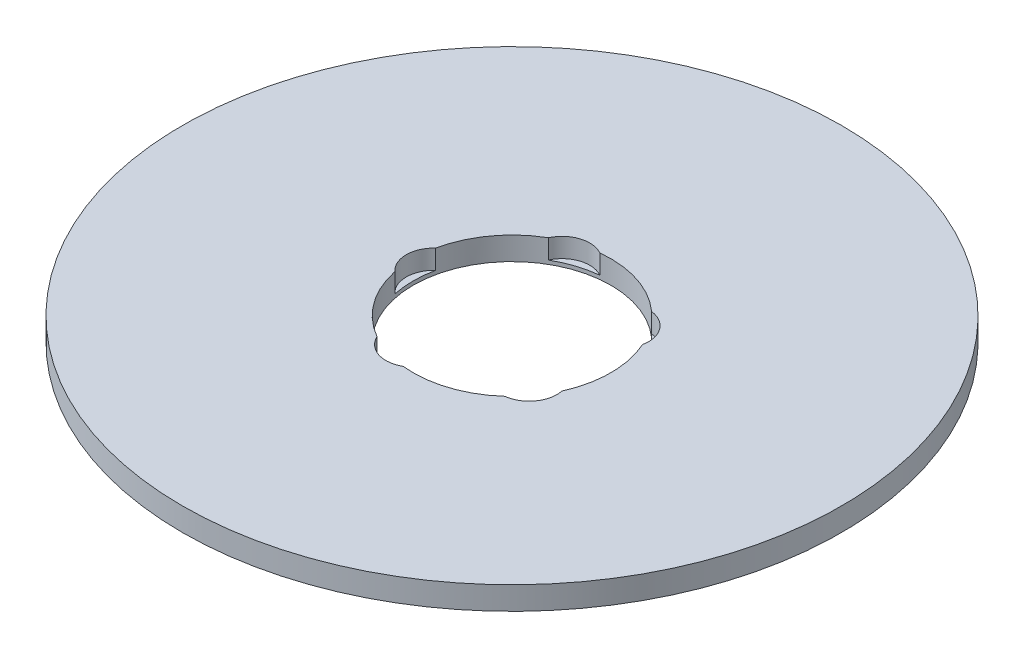
ISO-10303-21;
HEADER;
FILE_DESCRIPTION(('STEP AP214'),'2;1');
FILE_NAME('part.step','',(''),(''),'','','');
FILE_SCHEMA(('AUTOMOTIVE_DESIGN { 1 0 10303 214 1 1 1 1 }'));
ENDSEC;
DATA;
#1=APPLICATION_CONTEXT('core data for automotive mechanical design processes');
#2=APPLICATION_PROTOCOL_DEFINITION('international standard','automotive_design',2000,#1);
#3=PRODUCT_CONTEXT('',#1,'mechanical');
#4=PRODUCT('Part','Part','',(#3));
#5=PRODUCT_RELATED_PRODUCT_CATEGORY('part','',(#4));
#6=PRODUCT_DEFINITION_FORMATION('','',#4);
#7=PRODUCT_DEFINITION_CONTEXT('part definition',#1,'design');
#8=PRODUCT_DEFINITION('design','',#6,#7);
#9=PRODUCT_DEFINITION_SHAPE('','',#8);
#10=(LENGTH_UNIT() NAMED_UNIT(*) SI_UNIT(.MILLI.,.METRE.));
#11=(NAMED_UNIT(*) PLANE_ANGLE_UNIT() SI_UNIT($,.RADIAN.));
#12=(NAMED_UNIT(*) SI_UNIT($,.STERADIAN.) SOLID_ANGLE_UNIT());
#13=UNCERTAINTY_MEASURE_WITH_UNIT(LENGTH_MEASURE(1.E-05),#10,'distance_accuracy_value','');
#14=(GEOMETRIC_REPRESENTATION_CONTEXT(3) GLOBAL_UNCERTAINTY_ASSIGNED_CONTEXT((#13)) GLOBAL_UNIT_ASSIGNED_CONTEXT((#10,
#11,#12)) REPRESENTATION_CONTEXT('',''));
#15=CARTESIAN_POINT('',(0.,0.,0.));
#16=DIRECTION('',(0.,0.,1.));
#17=DIRECTION('',(1.,0.,0.));
#18=AXIS2_PLACEMENT_3D('',#15,#16,#17);
#19=CARTESIAN_POINT('',(0.,7.,0.));
#20=DIRECTION('',(0.,-1.,0.));
#21=DIRECTION('',(0.,0.,-1.));
#22=AXIS2_PLACEMENT_3D('',#19,#20,#21);
#23=CYLINDRICAL_SURFACE('',#22,100.);
#24=CARTESIAN_POINT('',(0.,7.,0.));
#25=DIRECTION('',(0.,1.,0.));
#26=DIRECTION('',(0.,0.,1.));
#27=AXIS2_PLACEMENT_3D('',#24,#25,#26);
#28=CIRCLE('',#27,100.);
#29=CARTESIAN_POINT('',(0.,7.,100.));
#30=VERTEX_POINT('',#29);
#31=EDGE_CURVE('E151',#30,#30,#28,.T.);
#32=ORIENTED_EDGE('',*,*,#31,.F.);
#33=EDGE_LOOP('',(#32));
#34=FACE_BOUND('',#33,.T.);
#35=CARTESIAN_POINT('',(0.,0.,0.));
#36=DIRECTION('',(0.,1.,0.));
#37=DIRECTION('',(0.,0.,1.));
#38=AXIS2_PLACEMENT_3D('',#35,#36,#37);
#39=CIRCLE('',#38,100.);
#40=CARTESIAN_POINT('',(0.,0.,100.));
#41=VERTEX_POINT('',#40);
#42=EDGE_CURVE('E150',#41,#41,#39,.T.);
#43=ORIENTED_EDGE('',*,*,#42,.T.);
#44=EDGE_LOOP('',(#43));
#45=FACE_BOUND('',#44,.T.);
#46=ADVANCED_FACE('F39',(#34,#45),#23,.T.);
#47=CARTESIAN_POINT('',(0.,7.,0.));
#48=DIRECTION('',(0.,1.,0.));
#49=DIRECTION('',(0.,0.,1.));
#50=AXIS2_PLACEMENT_3D('',#47,#48,#49);
#51=PLANE('',#50);
#52=CARTESIAN_POINT('',(-7.31040391788296,7.,-22.499109788169));
#53=DIRECTION('',(0.,1.,0.));
#54=DIRECTION('',(-0.95105651629515,0.,0.309016994374958));
#55=AXIS2_PLACEMENT_3D('',#52,#53,#54);
#56=CIRCLE('',#55,8.41606522873374);
#57=CARTESIAN_POINT('',(-3.17862193438334,7.,-29.8311307629841));
#58=VERTEX_POINT('',#57);
#59=CARTESIAN_POINT('',(-14.9627395580819,7.,-26.002238844319));
#60=VERTEX_POINT('',#59);
#61=EDGE_CURVE('E196',#58,#60,#56,.T.);
#62=ORIENTED_EDGE('',*,*,#61,.F.);
#63=CARTESIAN_POINT('',(0.,7.,0.));
#64=DIRECTION('',(0.,1.,0.));
#65=DIRECTION('',(0.,0.,1.));
#66=AXIS2_PLACEMENT_3D('',#63,#64,#65);
#67=CIRCLE('',#66,30.);
#68=CARTESIAN_POINT('',(20.105857885299,7.,-22.2655446530319));
#69=VERTEX_POINT('',#68);
#70=EDGE_CURVE('E156',#69,#58,#67,.T.);
#71=ORIENTED_EDGE('',*,*,#70,.F.);
#72=CARTESIAN_POINT('',(19.1388859285072,7.,-13.9052145657041));
#73=DIRECTION('',(0.,1.,0.));
#74=DIRECTION('',(-0.58778525229248,0.,-0.809016994374942));
#75=AXIS2_PLACEMENT_3D('',#72,#73,#74);
#76=CIRCLE('',#75,8.41606522873374);
#77=CARTESIAN_POINT('',(27.3888431041715,7.,-12.2413754707173));
#78=VERTEX_POINT('',#77);
#79=EDGE_CURVE('E254',#78,#69,#76,.T.);
#80=ORIENTED_EDGE('',*,*,#79,.F.);
#81=CARTESIAN_POINT('',(27.3888431041716,7.,12.2413754707169));
#82=VERTEX_POINT('',#81);
#83=EDGE_CURVE('E153',#82,#78,#67,.T.);
#84=ORIENTED_EDGE('',*,*,#83,.F.);
#85=CARTESIAN_POINT('',(19.1388859285074,7.,13.9052145657038));
#86=DIRECTION('',(0.,1.,0.));
#87=DIRECTION('',(0.587785252292469,0.,-0.809016994374951));
#88=AXIS2_PLACEMENT_3D('',#85,#86,#87);
#89=CIRCLE('',#88,8.41606522873374);
#90=CARTESIAN_POINT('',(20.1058578852993,7.,22.2655446530317));
#91=VERTEX_POINT('',#90);
#92=EDGE_CURVE('E248',#91,#82,#89,.T.);
#93=ORIENTED_EDGE('',*,*,#92,.F.);
#94=CARTESIAN_POINT('',(-3.17862193438291,7.,29.8311307629842));
#95=VERTEX_POINT('',#94);
#96=EDGE_CURVE('E140',#95,#91,#67,.T.);
#97=ORIENTED_EDGE('',*,*,#96,.F.);
#98=CARTESIAN_POINT('',(-7.31040391788264,7.,22.4991097881691));
#99=DIRECTION('',(0.,1.,0.));
#100=DIRECTION('',(0.951056516295155,0.,0.309016994374945));
#101=AXIS2_PLACEMENT_3D('',#98,#99,#100);
#102=CIRCLE('',#101,8.41606522873374);
#103=CARTESIAN_POINT('',(-14.9627395580815,7.,26.0022388443192));
#104=VERTEX_POINT('',#103);
#105=EDGE_CURVE('E117',#104,#95,#102,.T.);
#106=ORIENTED_EDGE('',*,*,#105,.F.);
#107=CARTESIAN_POINT('',(-29.3533394970062,7.,6.19527726364974));
#108=VERTEX_POINT('',#107);
#109=EDGE_CURVE('E133',#108,#104,#67,.T.);
#110=ORIENTED_EDGE('',*,*,#109,.F.);
#111=CARTESIAN_POINT('',(-23.6569640212492,7.,0.));
#112=DIRECTION('',(0.,1.,0.));
#113=DIRECTION('',(0.,0.,1.));
#114=AXIS2_PLACEMENT_3D('',#111,#112,#113);
#115=CIRCLE('',#114,8.41606522873374);
#116=CARTESIAN_POINT('',(-29.3533394970062,7.,-6.19527726364974));
#117=VERTEX_POINT('',#116);
#118=EDGE_CURVE('E170',#117,#108,#115,.T.);
#119=ORIENTED_EDGE('',*,*,#118,.F.);
#120=EDGE_CURVE('E149',#60,#117,#67,.T.);
#121=ORIENTED_EDGE('',*,*,#120,.F.);
#122=EDGE_LOOP('',(#62,#71,#80,#84,#93,#97,#106,#110,#119,#121));
#123=FACE_BOUND('',#122,.T.);
#124=ORIENTED_EDGE('',*,*,#31,.T.);
#125=EDGE_LOOP('',(#124));
#126=FACE_BOUND('',#125,.T.);
#127=ADVANCED_FACE('F131',(#123,#126),#51,.T.);
#128=CARTESIAN_POINT('',(0.,0.,0.));
#129=DIRECTION('',(0.,1.,0.));
#130=DIRECTION('',(0.,0.,1.));
#131=AXIS2_PLACEMENT_3D('',#128,#129,#130);
#132=PLANE('',#131);
#133=CARTESIAN_POINT('',(0.,0.,0.));
#134=DIRECTION('',(0.,1.,0.));
#135=DIRECTION('',(0.,0.,1.));
#136=AXIS2_PLACEMENT_3D('',#133,#134,#135);
#137=CIRCLE('',#136,30.);
#138=CARTESIAN_POINT('',(0.,0.,30.));
#139=VERTEX_POINT('',#138);
#140=EDGE_CURVE('E160',#139,#139,#137,.T.);
#141=ORIENTED_EDGE('',*,*,#140,.T.);
#142=EDGE_LOOP('',(#141));
#143=FACE_BOUND('',#142,.T.);
#144=ORIENTED_EDGE('',*,*,#42,.F.);
#145=EDGE_LOOP('',(#144));
#146=FACE_BOUND('',#145,.T.);
#147=ADVANCED_FACE('F212',(#143,#146),#132,.F.);
#148=CARTESIAN_POINT('',(0.,7.,0.));
#149=DIRECTION('',(0.,-1.,0.));
#150=DIRECTION('',(0.,0.,-1.));
#151=AXIS2_PLACEMENT_3D('',#148,#149,#150);
#152=CYLINDRICAL_SURFACE('',#151,30.);
#153=DIRECTION('',(0.,1.,0.));
#154=VECTOR('',#153,1.);
#155=CARTESIAN_POINT('',(-3.17862193438334,4.06807025845378,-29.8311307629841));
#156=LINE('',#155,#154);
#157=CARTESIAN_POINT('',(-3.17862193438334,1.13614051690756,-29.8311307629841));
#158=VERTEX_POINT('',#157);
#159=EDGE_CURVE('E11',#158,#58,#156,.T.);
#160=ORIENTED_EDGE('',*,*,#159,.F.);
#161=CARTESIAN_POINT('',(0.,1.13614051690756,0.));
#162=DIRECTION('',(0.,1.,0.));
#163=DIRECTION('',(0.,0.,1.));
#164=AXIS2_PLACEMENT_3D('',#161,#162,#163);
#165=CIRCLE('',#164,30.);
#166=CARTESIAN_POINT('',(-14.9627395580819,1.13614051690756,-26.002238844319));
#167=VERTEX_POINT('',#166);
#168=EDGE_CURVE('E193',#158,#167,#165,.T.);
#169=ORIENTED_EDGE('',*,*,#168,.T.);
#170=DIRECTION('',(0.,1.,0.));
#171=VECTOR('',#170,1.);
#172=CARTESIAN_POINT('',(-14.9627395580819,4.06807025845378,-26.002238844319));
#173=LINE('',#172,#171);
#174=EDGE_CURVE('E46',#60,#167,#173,.F.);
#175=ORIENTED_EDGE('',*,*,#174,.F.);
#176=ORIENTED_EDGE('',*,*,#120,.T.);
#177=DIRECTION('',(0.,1.,0.));
#178=VECTOR('',#177,1.);
#179=CARTESIAN_POINT('',(-29.3533394970062,4.06807025845378,-6.19527726364974));
#180=LINE('',#179,#178);
#181=CARTESIAN_POINT('',(-29.3533394970062,1.13614051690756,-6.19527726364974));
#182=VERTEX_POINT('',#181);
#183=EDGE_CURVE('E174',#182,#117,#180,.T.);
#184=ORIENTED_EDGE('',*,*,#183,.F.);
#185=CARTESIAN_POINT('',(0.,1.13614051690756,0.));
#186=DIRECTION('',(0.,1.,0.));
#187=DIRECTION('',(0.,0.,1.));
#188=AXIS2_PLACEMENT_3D('',#185,#186,#187);
#189=CIRCLE('',#188,30.);
#190=CARTESIAN_POINT('',(-29.3533394970062,1.13614051690756,6.19527726364974));
#191=VERTEX_POINT('',#190);
#192=EDGE_CURVE('E171',#182,#191,#189,.T.);
#193=ORIENTED_EDGE('',*,*,#192,.T.);
#194=DIRECTION('',(0.,1.,0.));
#195=VECTOR('',#194,1.);
#196=CARTESIAN_POINT('',(-29.3533394970062,4.06807025845378,6.19527726364974));
#197=LINE('',#196,#195);
#198=EDGE_CURVE('E148',#108,#191,#197,.F.);
#199=ORIENTED_EDGE('',*,*,#198,.F.);
#200=ORIENTED_EDGE('',*,*,#109,.T.);
#201=DIRECTION('',(0.,1.,0.));
#202=VECTOR('',#201,1.);
#203=CARTESIAN_POINT('',(-14.9627395580815,4.06807025845378,26.0022388443192));
#204=LINE('',#203,#202);
#205=CARTESIAN_POINT('',(-14.9627395580815,1.13614051690756,26.0022388443192));
#206=VERTEX_POINT('',#205);
#207=EDGE_CURVE('E111',#206,#104,#204,.T.);
#208=ORIENTED_EDGE('',*,*,#207,.F.);
#209=CARTESIAN_POINT('',(0.,1.13614051690756,0.));
#210=DIRECTION('',(0.,1.,0.));
#211=DIRECTION('',(0.,0.,1.));
#212=AXIS2_PLACEMENT_3D('',#209,#210,#211);
#213=CIRCLE('',#212,30.);
#214=CARTESIAN_POINT('',(-3.17862193438291,1.13614051690756,29.8311307629842));
#215=VERTEX_POINT('',#214);
#216=EDGE_CURVE('E180',#206,#215,#213,.T.);
#217=ORIENTED_EDGE('',*,*,#216,.T.);
#218=DIRECTION('',(0.,1.,0.));
#219=VECTOR('',#218,1.);
#220=CARTESIAN_POINT('',(-3.17862193438291,4.06807025845378,29.8311307629842));
#221=LINE('',#220,#219);
#222=EDGE_CURVE('E124',#95,#215,#221,.F.);
#223=ORIENTED_EDGE('',*,*,#222,.F.);
#224=ORIENTED_EDGE('',*,*,#96,.T.);
#225=DIRECTION('',(0.,1.,0.));
#226=VECTOR('',#225,1.);
#227=CARTESIAN_POINT('',(20.1058578852993,4.06807025845378,22.2655446530317));
#228=LINE('',#227,#226);
#229=CARTESIAN_POINT('',(20.1058578852993,1.13614051690756,22.2655446530317));
#230=VERTEX_POINT('',#229);
#231=EDGE_CURVE('E183',#230,#91,#228,.T.);
#232=ORIENTED_EDGE('',*,*,#231,.F.);
#233=CARTESIAN_POINT('',(0.,1.13614051690756,0.));
#234=DIRECTION('',(0.,1.,0.));
#235=DIRECTION('',(0.,0.,1.));
#236=AXIS2_PLACEMENT_3D('',#233,#234,#235);
#237=CIRCLE('',#236,30.);
#238=CARTESIAN_POINT('',(27.3888431041716,1.13614051690756,12.2413754707169));
#239=VERTEX_POINT('',#238);
#240=EDGE_CURVE('E123',#230,#239,#237,.T.);
#241=ORIENTED_EDGE('',*,*,#240,.T.);
#242=DIRECTION('',(0.,1.,0.));
#243=VECTOR('',#242,1.);
#244=CARTESIAN_POINT('',(27.3888431041716,4.06807025845378,12.2413754707169));
#245=LINE('',#244,#243);
#246=EDGE_CURVE('E185',#82,#239,#245,.F.);
#247=ORIENTED_EDGE('',*,*,#246,.F.);
#248=ORIENTED_EDGE('',*,*,#83,.T.);
#249=DIRECTION('',(0.,1.,0.));
#250=VECTOR('',#249,1.);
#251=CARTESIAN_POINT('',(27.3888431041715,4.06807025845378,-12.2413754707173));
#252=LINE('',#251,#250);
#253=CARTESIAN_POINT('',(27.3888431041715,1.13614051690756,-12.2413754707173));
#254=VERTEX_POINT('',#253);
#255=EDGE_CURVE('E195',#254,#78,#252,.T.);
#256=ORIENTED_EDGE('',*,*,#255,.F.);
#257=CARTESIAN_POINT('',(0.,1.13614051690756,0.));
#258=DIRECTION('',(0.,1.,0.));
#259=DIRECTION('',(0.,0.,1.));
#260=AXIS2_PLACEMENT_3D('',#257,#258,#259);
#261=CIRCLE('',#260,30.);
#262=CARTESIAN_POINT('',(20.105857885299,1.13614051690756,-22.2655446530319));
#263=VERTEX_POINT('',#262);
#264=EDGE_CURVE('E190',#254,#263,#261,.T.);
#265=ORIENTED_EDGE('',*,*,#264,.T.);
#266=DIRECTION('',(0.,1.,0.));
#267=VECTOR('',#266,1.);
#268=CARTESIAN_POINT('',(20.105857885299,4.06807025845378,-22.2655446530319));
#269=LINE('',#268,#267);
#270=EDGE_CURVE('E189',#69,#263,#269,.F.);
#271=ORIENTED_EDGE('',*,*,#270,.F.);
#272=ORIENTED_EDGE('',*,*,#70,.T.);
#273=EDGE_LOOP('',(#160,#169,#175,#176,#184,#193,#199,#200,#208,#217,#223,#224,#232,#241,#247,
#248,#256,#265,#271,#272));
#274=FACE_BOUND('',#273,.T.);
#275=ORIENTED_EDGE('',*,*,#140,.F.);
#276=EDGE_LOOP('',(#275));
#277=FACE_BOUND('',#276,.T.);
#278=ADVANCED_FACE('F142',(#274,#277),#152,.F.);
#279=CARTESIAN_POINT('',(-23.6569640212492,1.13614051690756,0.));
#280=DIRECTION('',(0.,1.,0.));
#281=DIRECTION('',(0.,0.,1.));
#282=AXIS2_PLACEMENT_3D('',#279,#280,#281);
#283=CYLINDRICAL_SURFACE('',#282,8.41606522873374);
#284=ORIENTED_EDGE('',*,*,#183,.T.);
#285=ORIENTED_EDGE('',*,*,#118,.T.);
#286=ORIENTED_EDGE('',*,*,#198,.T.);
#287=CARTESIAN_POINT('',(-23.6569640212492,1.13614051690756,0.));
#288=DIRECTION('',(0.,1.,0.));
#289=DIRECTION('',(0.,0.,1.));
#290=AXIS2_PLACEMENT_3D('',#287,#288,#289);
#291=CIRCLE('',#290,8.41606522873374);
#292=EDGE_CURVE('E163',#182,#191,#291,.T.);
#293=ORIENTED_EDGE('',*,*,#292,.F.);
#294=EDGE_LOOP('',(#284,#285,#286,#293));
#295=FACE_BOUND('',#294,.T.);
#296=ADVANCED_FACE('F221',(#295),#283,.F.);
#297=CARTESIAN_POINT('',(-23.6569640212492,1.13614051690756,0.));
#298=DIRECTION('',(0.,1.,0.));
#299=DIRECTION('',(0.,0.,1.));
#300=AXIS2_PLACEMENT_3D('',#297,#298,#299);
#301=PLANE('',#300);
#302=ORIENTED_EDGE('',*,*,#292,.T.);
#303=ORIENTED_EDGE('',*,*,#192,.F.);
#304=EDGE_LOOP('',(#302,#303));
#305=FACE_BOUND('',#304,.T.);
#306=ADVANCED_FACE('F227',(#305),#301,.T.);
#307=CARTESIAN_POINT('',(-7.31040391788264,1.13614051690756,22.4991097881691));
#308=DIRECTION('',(0.,1.,0.));
#309=DIRECTION('',(0.,0.,1.));
#310=AXIS2_PLACEMENT_3D('',#307,#308,#309);
#311=CYLINDRICAL_SURFACE('',#310,8.41606522873374);
#312=ORIENTED_EDGE('',*,*,#207,.T.);
#313=ORIENTED_EDGE('',*,*,#105,.T.);
#314=ORIENTED_EDGE('',*,*,#222,.T.);
#315=CARTESIAN_POINT('',(-7.31040391788264,1.13614051690756,22.4991097881691));
#316=DIRECTION('',(0.,1.,0.));
#317=DIRECTION('',(0.951056516295155,0.,0.309016994374945));
#318=AXIS2_PLACEMENT_3D('',#315,#316,#317);
#319=CIRCLE('',#318,8.41606522873374);
#320=EDGE_CURVE('E119',#206,#215,#319,.T.);
#321=ORIENTED_EDGE('',*,*,#320,.F.);
#322=EDGE_LOOP('',(#312,#313,#314,#321));
#323=FACE_BOUND('',#322,.T.);
#324=ADVANCED_FACE('F116',(#323),#311,.F.);
#325=CARTESIAN_POINT('',(-7.31040391788264,1.13614051690756,22.4991097881691));
#326=DIRECTION('',(0.,1.,0.));
#327=DIRECTION('',(0.951056516295155,0.,0.309016994374945));
#328=AXIS2_PLACEMENT_3D('',#325,#326,#327);
#329=PLANE('',#328);
#330=ORIENTED_EDGE('',*,*,#320,.T.);
#331=ORIENTED_EDGE('',*,*,#216,.F.);
#332=EDGE_LOOP('',(#330,#331));
#333=FACE_BOUND('',#332,.T.);
#334=ADVANCED_FACE('F234',(#333),#329,.T.);
#335=CARTESIAN_POINT('',(19.1388859285074,1.13614051690756,13.9052145657038));
#336=DIRECTION('',(0.,1.,0.));
#337=DIRECTION('',(0.,0.,1.));
#338=AXIS2_PLACEMENT_3D('',#335,#336,#337);
#339=CYLINDRICAL_SURFACE('',#338,8.41606522873374);
#340=ORIENTED_EDGE('',*,*,#231,.T.);
#341=ORIENTED_EDGE('',*,*,#92,.T.);
#342=ORIENTED_EDGE('',*,*,#246,.T.);
#343=CARTESIAN_POINT('',(19.1388859285074,1.13614051690756,13.9052145657038));
#344=DIRECTION('',(0.,1.,0.));
#345=DIRECTION('',(0.587785252292469,0.,-0.809016994374951));
#346=AXIS2_PLACEMENT_3D('',#343,#344,#345);
#347=CIRCLE('',#346,8.41606522873374);
#348=EDGE_CURVE('E137',#230,#239,#347,.T.);
#349=ORIENTED_EDGE('',*,*,#348,.F.);
#350=EDGE_LOOP('',(#340,#341,#342,#349));
#351=FACE_BOUND('',#350,.T.);
#352=ADVANCED_FACE('F240',(#351),#339,.F.);
#353=CARTESIAN_POINT('',(19.1388859285074,1.13614051690756,13.9052145657038));
#354=DIRECTION('',(0.,1.,0.));
#355=DIRECTION('',(0.587785252292469,0.,-0.809016994374951));
#356=AXIS2_PLACEMENT_3D('',#353,#354,#355);
#357=PLANE('',#356);
#358=ORIENTED_EDGE('',*,*,#348,.T.);
#359=ORIENTED_EDGE('',*,*,#240,.F.);
#360=EDGE_LOOP('',(#358,#359));
#361=FACE_BOUND('',#360,.T.);
#362=ADVANCED_FACE('F245',(#361),#357,.T.);
#363=CARTESIAN_POINT('',(19.1388859285072,1.13614051690756,-13.9052145657041));
#364=DIRECTION('',(0.,1.,0.));
#365=DIRECTION('',(0.,0.,1.));
#366=AXIS2_PLACEMENT_3D('',#363,#364,#365);
#367=CYLINDRICAL_SURFACE('',#366,8.41606522873374);
#368=ORIENTED_EDGE('',*,*,#255,.T.);
#369=ORIENTED_EDGE('',*,*,#79,.T.);
#370=ORIENTED_EDGE('',*,*,#270,.T.);
#371=CARTESIAN_POINT('',(19.1388859285072,1.13614051690756,-13.9052145657041));
#372=DIRECTION('',(0.,1.,0.));
#373=DIRECTION('',(-0.58778525229248,0.,-0.809016994374942));
#374=AXIS2_PLACEMENT_3D('',#371,#372,#373);
#375=CIRCLE('',#374,8.41606522873374);
#376=EDGE_CURVE('E56',#254,#263,#375,.T.);
#377=ORIENTED_EDGE('',*,*,#376,.F.);
#378=EDGE_LOOP('',(#368,#369,#370,#377));
#379=FACE_BOUND('',#378,.T.);
#380=ADVANCED_FACE('F264',(#379),#367,.F.);
#381=CARTESIAN_POINT('',(19.1388859285072,1.13614051690756,-13.9052145657041));
#382=DIRECTION('',(0.,1.,0.));
#383=DIRECTION('',(-0.58778525229248,0.,-0.809016994374942));
#384=AXIS2_PLACEMENT_3D('',#381,#382,#383);
#385=PLANE('',#384);
#386=ORIENTED_EDGE('',*,*,#376,.T.);
#387=ORIENTED_EDGE('',*,*,#264,.F.);
#388=EDGE_LOOP('',(#386,#387));
#389=FACE_BOUND('',#388,.T.);
#390=ADVANCED_FACE('F202',(#389),#385,.T.);
#391=CARTESIAN_POINT('',(-7.31040391788296,1.13614051690756,-22.499109788169));
#392=DIRECTION('',(0.,1.,0.));
#393=DIRECTION('',(0.,0.,1.));
#394=AXIS2_PLACEMENT_3D('',#391,#392,#393);
#395=CYLINDRICAL_SURFACE('',#394,8.41606522873374);
#396=ORIENTED_EDGE('',*,*,#159,.T.);
#397=ORIENTED_EDGE('',*,*,#61,.T.);
#398=ORIENTED_EDGE('',*,*,#174,.T.);
#399=CARTESIAN_POINT('',(-7.31040391788296,1.13614051690756,-22.499109788169));
#400=DIRECTION('',(0.,1.,0.));
#401=DIRECTION('',(-0.95105651629515,0.,0.309016994374958));
#402=AXIS2_PLACEMENT_3D('',#399,#400,#401);
#403=CIRCLE('',#402,8.41606522873374);
#404=EDGE_CURVE('E55',#158,#167,#403,.T.);
#405=ORIENTED_EDGE('',*,*,#404,.F.);
#406=EDGE_LOOP('',(#396,#397,#398,#405));
#407=FACE_BOUND('',#406,.T.);
#408=ADVANCED_FACE('F197',(#407),#395,.F.);
#409=CARTESIAN_POINT('',(-7.31040391788296,1.13614051690756,-22.499109788169));
#410=DIRECTION('',(0.,1.,0.));
#411=DIRECTION('',(-0.95105651629515,0.,0.309016994374958));
#412=AXIS2_PLACEMENT_3D('',#409,#410,#411);
#413=PLANE('',#412);
#414=ORIENTED_EDGE('',*,*,#404,.T.);
#415=ORIENTED_EDGE('',*,*,#168,.F.);
#416=EDGE_LOOP('',(#414,#415));
#417=FACE_BOUND('',#416,.T.);
#418=ADVANCED_FACE('F200',(#417),#413,.T.);
#419=CLOSED_SHELL('',(#46,#127,#147,#278,#296,#306,#324,#334,#352,#362,#380,#390,#408,#418));
#420=MANIFOLD_SOLID_BREP('B2',#419);
#421=ADVANCED_BREP_SHAPE_REPRESENTATION('',(#18,#420),#14);
#422=SHAPE_DEFINITION_REPRESENTATION(#9,#421);
ENDSEC;
END-ISO-10303-21;
